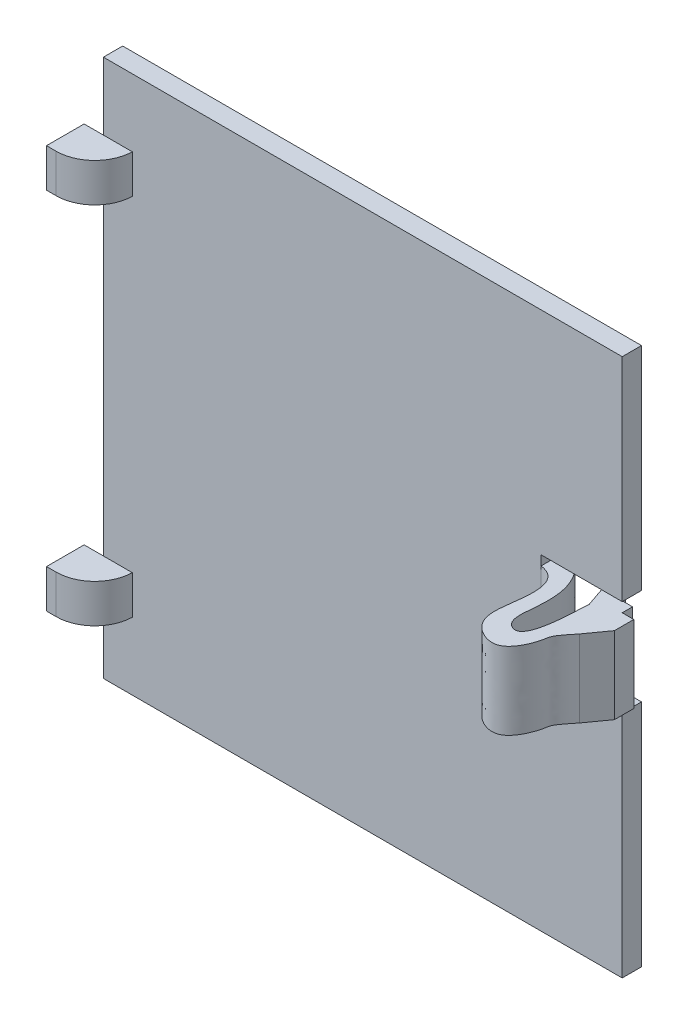
ISO-10303-21;
HEADER;
FILE_DESCRIPTION(('STEP AP214'),'2;1');
FILE_NAME('part.step','',(''),(''),'','','');
FILE_SCHEMA(('AUTOMOTIVE_DESIGN { 1 0 10303 214 1 1 1 1 }'));
ENDSEC;
DATA;
#1=APPLICATION_CONTEXT('core data for automotive mechanical design processes');
#2=APPLICATION_PROTOCOL_DEFINITION('international standard','automotive_design',2000,#1);
#3=PRODUCT_CONTEXT('',#1,'mechanical');
#4=PRODUCT('Part','Part','',(#3));
#5=PRODUCT_RELATED_PRODUCT_CATEGORY('part','',(#4));
#6=PRODUCT_DEFINITION_FORMATION('','',#4);
#7=PRODUCT_DEFINITION_CONTEXT('part definition',#1,'design');
#8=PRODUCT_DEFINITION('design','',#6,#7);
#9=PRODUCT_DEFINITION_SHAPE('','',#8);
#10=(LENGTH_UNIT() NAMED_UNIT(*) SI_UNIT(.MILLI.,.METRE.));
#11=(NAMED_UNIT(*) PLANE_ANGLE_UNIT() SI_UNIT($,.RADIAN.));
#12=(NAMED_UNIT(*) SI_UNIT($,.STERADIAN.) SOLID_ANGLE_UNIT());
#13=UNCERTAINTY_MEASURE_WITH_UNIT(LENGTH_MEASURE(1.E-05),#10,'distance_accuracy_value','');
#14=(GEOMETRIC_REPRESENTATION_CONTEXT(3) GLOBAL_UNCERTAINTY_ASSIGNED_CONTEXT((#13)) GLOBAL_UNIT_ASSIGNED_CONTEXT((#10,
#11,#12)) REPRESENTATION_CONTEXT('',''));
#15=CARTESIAN_POINT('',(0.,0.,0.));
#16=DIRECTION('',(0.,0.,1.));
#17=DIRECTION('',(1.,0.,0.));
#18=AXIS2_PLACEMENT_3D('',#15,#16,#17);
#19=CARTESIAN_POINT('',(45.3873995472666,33.8,-5.8));
#20=DIRECTION('',(-1.,0.,0.));
#21=DIRECTION('',(0.,0.,1.));
#22=AXIS2_PLACEMENT_3D('',#19,#20,#21);
#23=PLANE('',#22);
#24=DIRECTION('',(0.,0.,-1.));
#25=VECTOR('',#24,1.);
#26=CARTESIAN_POINT('',(45.3873995472666,32.8,2.));
#27=LINE('',#26,#25);
#28=CARTESIAN_POINT('',(45.3873995472666,32.8,2.));
#29=VERTEX_POINT('',#28);
#30=CARTESIAN_POINT('',(45.3873995472666,32.8,0.));
#31=VERTEX_POINT('',#30);
#32=EDGE_CURVE('E56',#29,#31,#27,.T.);
#33=ORIENTED_EDGE('',*,*,#32,.T.);
#34=DIRECTION('',(0.,1.,0.));
#35=VECTOR('',#34,1.);
#36=CARTESIAN_POINT('',(45.3873995472666,0.,0.));
#37=LINE('',#36,#35);
#38=CARTESIAN_POINT('',(45.3873995472666,33.8,0.));
#39=VERTEX_POINT('',#38);
#40=EDGE_CURVE('E456',#31,#39,#37,.T.);
#41=ORIENTED_EDGE('',*,*,#40,.T.);
#42=DIRECTION('',(0.,0.,1.));
#43=VECTOR('',#42,1.);
#44=CARTESIAN_POINT('',(45.3873995472666,33.8,-5.8));
#45=LINE('',#44,#43);
#46=CARTESIAN_POINT('',(45.3873995472666,33.8,2.));
#47=VERTEX_POINT('',#46);
#48=EDGE_CURVE('E460',#39,#47,#45,.T.);
#49=ORIENTED_EDGE('',*,*,#48,.T.);
#50=DIRECTION('',(0.,-1.,0.));
#51=VECTOR('',#50,1.);
#52=CARTESIAN_POINT('',(45.3873995472666,33.8,2.));
#53=LINE('',#52,#51);
#54=EDGE_CURVE('E506',#47,#29,#53,.T.);
#55=ORIENTED_EDGE('',*,*,#54,.T.);
#56=EDGE_LOOP('',(#33,#41,#49,#55));
#57=FACE_BOUND('',#56,.T.);
#58=ADVANCED_FACE('F33',(#57),#23,.F.);
#59=CARTESIAN_POINT('',(53.8,0.,2.));
#60=DIRECTION('',(-1.,0.,0.));
#61=DIRECTION('',(0.,0.,1.));
#62=AXIS2_PLACEMENT_3D('',#59,#60,#61);
#63=PLANE('',#62);
#64=DIRECTION('',(0.,1.,0.));
#65=VECTOR('',#64,1.);
#66=CARTESIAN_POINT('',(53.8,0.,0.));
#67=LINE('',#66,#65);
#68=CARTESIAN_POINT('',(53.8,0.,0.));
#69=VERTEX_POINT('',#68);
#70=CARTESIAN_POINT('',(53.8,23.8,0.));
#71=VERTEX_POINT('',#70);
#72=EDGE_CURVE('E413',#69,#71,#67,.T.);
#73=ORIENTED_EDGE('',*,*,#72,.T.);
#74=DIRECTION('',(0.,0.,1.));
#75=VECTOR('',#74,1.);
#76=CARTESIAN_POINT('',(53.8,23.8,-5.8));
#77=LINE('',#76,#75);
#78=CARTESIAN_POINT('',(53.8,23.8,2.));
#79=VERTEX_POINT('',#78);
#80=EDGE_CURVE('E415',#71,#79,#77,.T.);
#81=ORIENTED_EDGE('',*,*,#80,.T.);
#82=DIRECTION('',(0.,1.,0.));
#83=VECTOR('',#82,1.);
#84=CARTESIAN_POINT('',(53.8,0.,2.));
#85=LINE('',#84,#83);
#86=CARTESIAN_POINT('',(53.8,0.,2.));
#87=VERTEX_POINT('',#86);
#88=EDGE_CURVE('E479',#87,#79,#85,.T.);
#89=ORIENTED_EDGE('',*,*,#88,.F.);
#90=DIRECTION('',(0.,0.,-1.));
#91=VECTOR('',#90,1.);
#92=CARTESIAN_POINT('',(53.8,0.,2.));
#93=LINE('',#92,#91);
#94=EDGE_CURVE('E418',#87,#69,#93,.T.);
#95=ORIENTED_EDGE('',*,*,#94,.T.);
#96=EDGE_LOOP('',(#73,#81,#89,#95));
#97=FACE_BOUND('',#96,.T.);
#98=ADVANCED_FACE('F376',(#97),#63,.F.);
#99=CARTESIAN_POINT('',(0.,0.,2.));
#100=DIRECTION('',(0.,0.,-1.));
#101=DIRECTION('',(-1.,0.,0.));
#102=AXIS2_PLACEMENT_3D('',#99,#100,#101);
#103=PLANE('',#102);
#104=ORIENTED_EDGE('',*,*,#88,.T.);
#105=DIRECTION('',(1.,0.,0.));
#106=VECTOR('',#105,1.);
#107=CARTESIAN_POINT('',(53.8,23.8,2.));
#108=LINE('',#107,#106);
#109=CARTESIAN_POINT('',(45.3873995472666,23.8,2.));
#110=VERTEX_POINT('',#109);
#111=EDGE_CURVE('E512',#110,#79,#108,.T.);
#112=ORIENTED_EDGE('',*,*,#111,.F.);
#113=CARTESIAN_POINT('',(45.3873995472666,24.8,2.));
#114=VERTEX_POINT('',#113);
#115=EDGE_CURVE('E507',#114,#110,#53,.T.);
#116=ORIENTED_EDGE('',*,*,#115,.F.);
#117=DIRECTION('',(0.,1.,0.));
#118=VECTOR('',#117,1.);
#119=CARTESIAN_POINT('',(45.3873995472666,24.8,2.));
#120=LINE('',#119,#118);
#121=EDGE_CURVE('E274',#114,#29,#120,.T.);
#122=ORIENTED_EDGE('',*,*,#121,.T.);
#123=ORIENTED_EDGE('',*,*,#54,.F.);
#124=DIRECTION('',(-1.,0.,0.));
#125=VECTOR('',#124,1.);
#126=CARTESIAN_POINT('',(53.8,33.8,2.));
#127=LINE('',#126,#125);
#128=CARTESIAN_POINT('',(53.8,33.8,2.));
#129=VERTEX_POINT('',#128);
#130=EDGE_CURVE('E465',#129,#47,#127,.T.);
#131=ORIENTED_EDGE('',*,*,#130,.F.);
#132=CARTESIAN_POINT('',(53.8,55.8,2.));
#133=VERTEX_POINT('',#132);
#134=EDGE_CURVE('E481',#129,#133,#85,.T.);
#135=ORIENTED_EDGE('',*,*,#134,.T.);
#136=DIRECTION('',(-1.,0.,0.));
#137=VECTOR('',#136,1.);
#138=CARTESIAN_POINT('',(0.,55.8,2.));
#139=LINE('',#138,#137);
#140=CARTESIAN_POINT('',(0.,55.8,2.));
#141=VERTEX_POINT('',#140);
#142=EDGE_CURVE('E433',#133,#141,#139,.T.);
#143=ORIENTED_EDGE('',*,*,#142,.T.);
#144=DIRECTION('',(0.,-1.,0.));
#145=VECTOR('',#144,1.);
#146=CARTESIAN_POINT('',(0.,0.,2.));
#147=LINE('',#146,#145);
#148=CARTESIAN_POINT('',(0.,48.8,2.));
#149=VERTEX_POINT('',#148);
#150=EDGE_CURVE('E499',#141,#149,#147,.T.);
#151=ORIENTED_EDGE('',*,*,#150,.T.);
#152=DIRECTION('',(-1.,0.,0.));
#153=VECTOR('',#152,1.);
#154=CARTESIAN_POINT('',(3.,48.8,2.));
#155=LINE('',#154,#153);
#156=CARTESIAN_POINT('',(3.,48.8,2.));
#157=VERTEX_POINT('',#156);
#158=EDGE_CURVE('E531',#157,#149,#155,.T.);
#159=ORIENTED_EDGE('',*,*,#158,.F.);
#160=DIRECTION('',(0.,1.,0.));
#161=VECTOR('',#160,1.);
#162=CARTESIAN_POINT('',(3.,44.8,2.));
#163=LINE('',#162,#161);
#164=CARTESIAN_POINT('',(3.,44.8,2.));
#165=VERTEX_POINT('',#164);
#166=EDGE_CURVE('E515',#165,#157,#163,.T.);
#167=ORIENTED_EDGE('',*,*,#166,.F.);
#168=DIRECTION('',(1.,0.,0.));
#169=VECTOR('',#168,1.);
#170=CARTESIAN_POINT('',(3.,44.8,2.));
#171=LINE('',#170,#169);
#172=CARTESIAN_POINT('',(0.,44.8,2.));
#173=VERTEX_POINT('',#172);
#174=EDGE_CURVE('E536',#173,#165,#171,.T.);
#175=ORIENTED_EDGE('',*,*,#174,.F.);
#176=CARTESIAN_POINT('',(0.,11.,2.));
#177=VERTEX_POINT('',#176);
#178=EDGE_CURVE('E502',#173,#177,#147,.T.);
#179=ORIENTED_EDGE('',*,*,#178,.T.);
#180=DIRECTION('',(-1.,0.,0.));
#181=VECTOR('',#180,1.);
#182=CARTESIAN_POINT('',(3.,11.,2.));
#183=LINE('',#182,#181);
#184=CARTESIAN_POINT('',(3.,11.,2.));
#185=VERTEX_POINT('',#184);
#186=EDGE_CURVE('E555',#185,#177,#183,.T.);
#187=ORIENTED_EDGE('',*,*,#186,.F.);
#188=DIRECTION('',(0.,1.,0.));
#189=VECTOR('',#188,1.);
#190=CARTESIAN_POINT('',(3.,7.,2.));
#191=LINE('',#190,#189);
#192=CARTESIAN_POINT('',(3.,7.,2.));
#193=VERTEX_POINT('',#192);
#194=EDGE_CURVE('E544',#193,#185,#191,.T.);
#195=ORIENTED_EDGE('',*,*,#194,.F.);
#196=DIRECTION('',(1.,0.,0.));
#197=VECTOR('',#196,1.);
#198=CARTESIAN_POINT('',(3.,7.,2.));
#199=LINE('',#198,#197);
#200=CARTESIAN_POINT('',(0.,7.,2.));
#201=VERTEX_POINT('',#200);
#202=EDGE_CURVE('E440',#201,#193,#199,.T.);
#203=ORIENTED_EDGE('',*,*,#202,.F.);
#204=CARTESIAN_POINT('',(0.,0.,2.));
#205=VERTEX_POINT('',#204);
#206=EDGE_CURVE('E423',#201,#205,#147,.T.);
#207=ORIENTED_EDGE('',*,*,#206,.T.);
#208=DIRECTION('',(1.,0.,0.));
#209=VECTOR('',#208,1.);
#210=CARTESIAN_POINT('',(0.,0.,2.));
#211=LINE('',#210,#209);
#212=EDGE_CURVE('E500',#205,#87,#211,.T.);
#213=ORIENTED_EDGE('',*,*,#212,.T.);
#214=EDGE_LOOP('',(#104,#112,#116,#122,#123,#131,#135,#143,#151,#159,#167,#175,#179,#187,#195,
#203,#207,#213));
#215=FACE_BOUND('',#214,.T.);
#216=ADVANCED_FACE('F372',(#215),#103,.F.);
#217=CARTESIAN_POINT('',(0.,0.,2.));
#218=DIRECTION('',(1.,0.,0.));
#219=DIRECTION('',(0.,0.,-1.));
#220=AXIS2_PLACEMENT_3D('',#217,#218,#219);
#221=PLANE('',#220);
#222=DIRECTION('',(0.,-1.,0.));
#223=VECTOR('',#222,1.);
#224=CARTESIAN_POINT('',(0.,0.,0.));
#225=LINE('',#224,#223);
#226=CARTESIAN_POINT('',(0.,55.8,0.));
#227=VERTEX_POINT('',#226);
#228=CARTESIAN_POINT('',(0.,0.,0.));
#229=VERTEX_POINT('',#228);
#230=EDGE_CURVE('E484',#227,#229,#225,.T.);
#231=ORIENTED_EDGE('',*,*,#230,.T.);
#232=DIRECTION('',(0.,0.,-1.));
#233=VECTOR('',#232,1.);
#234=CARTESIAN_POINT('',(0.,0.,2.));
#235=LINE('',#234,#233);
#236=EDGE_CURVE('E437',#205,#229,#235,.T.);
#237=ORIENTED_EDGE('',*,*,#236,.F.);
#238=ORIENTED_EDGE('',*,*,#206,.F.);
#239=EDGE_CURVE('E503',#177,#201,#147,.T.);
#240=ORIENTED_EDGE('',*,*,#239,.F.);
#241=ORIENTED_EDGE('',*,*,#178,.F.);
#242=EDGE_CURVE('E501',#149,#173,#147,.T.);
#243=ORIENTED_EDGE('',*,*,#242,.F.);
#244=ORIENTED_EDGE('',*,*,#150,.F.);
#245=DIRECTION('',(0.,0.,-1.));
#246=VECTOR('',#245,1.);
#247=CARTESIAN_POINT('',(0.,55.8,2.));
#248=LINE('',#247,#246);
#249=EDGE_CURVE('E429',#141,#227,#248,.T.);
#250=ORIENTED_EDGE('',*,*,#249,.T.);
#251=EDGE_LOOP('',(#231,#237,#238,#240,#241,#243,#244,#250));
#252=FACE_BOUND('',#251,.T.);
#253=ADVANCED_FACE('F375',(#252),#221,.F.);
#254=CARTESIAN_POINT('',(0.,0.,2.));
#255=DIRECTION('',(0.,1.,0.));
#256=DIRECTION('',(0.,0.,1.));
#257=AXIS2_PLACEMENT_3D('',#254,#255,#256);
#258=PLANE('',#257);
#259=DIRECTION('',(1.,0.,0.));
#260=VECTOR('',#259,1.);
#261=CARTESIAN_POINT('',(0.,0.,0.));
#262=LINE('',#261,#260);
#263=EDGE_CURVE('E425',#229,#69,#262,.T.);
#264=ORIENTED_EDGE('',*,*,#263,.T.);
#265=ORIENTED_EDGE('',*,*,#94,.F.);
#266=ORIENTED_EDGE('',*,*,#212,.F.);
#267=ORIENTED_EDGE('',*,*,#236,.T.);
#268=EDGE_LOOP('',(#264,#265,#266,#267));
#269=FACE_BOUND('',#268,.T.);
#270=ADVANCED_FACE('F388',(#269),#258,.F.);
#271=ORIENTED_EDGE('',*,*,#134,.F.);
#272=DIRECTION('',(0.,0.,1.));
#273=VECTOR('',#272,1.);
#274=CARTESIAN_POINT('',(53.8,33.8,-5.8));
#275=LINE('',#274,#273);
#276=CARTESIAN_POINT('',(53.8,33.8,0.));
#277=VERTEX_POINT('',#276);
#278=EDGE_CURVE('E468',#277,#129,#275,.T.);
#279=ORIENTED_EDGE('',*,*,#278,.F.);
#280=CARTESIAN_POINT('',(53.8,55.8,0.));
#281=VERTEX_POINT('',#280);
#282=EDGE_CURVE('E421',#277,#281,#67,.T.);
#283=ORIENTED_EDGE('',*,*,#282,.T.);
#284=DIRECTION('',(0.,0.,-1.));
#285=VECTOR('',#284,1.);
#286=CARTESIAN_POINT('',(53.8,55.8,2.));
#287=LINE('',#286,#285);
#288=EDGE_CURVE('E432',#133,#281,#287,.T.);
#289=ORIENTED_EDGE('',*,*,#288,.F.);
#290=EDGE_LOOP('',(#271,#279,#283,#289));
#291=FACE_BOUND('',#290,.T.);
#292=ADVANCED_FACE('F384',(#291),#63,.F.);
#293=CARTESIAN_POINT('',(0.,55.8,2.));
#294=DIRECTION('',(0.,-1.,0.));
#295=DIRECTION('',(0.,0.,-1.));
#296=AXIS2_PLACEMENT_3D('',#293,#294,#295);
#297=PLANE('',#296);
#298=DIRECTION('',(-1.,0.,0.));
#299=VECTOR('',#298,1.);
#300=CARTESIAN_POINT('',(0.,55.8,0.));
#301=LINE('',#300,#299);
#302=EDGE_CURVE('E420',#281,#227,#301,.T.);
#303=ORIENTED_EDGE('',*,*,#302,.T.);
#304=ORIENTED_EDGE('',*,*,#249,.F.);
#305=ORIENTED_EDGE('',*,*,#142,.F.);
#306=ORIENTED_EDGE('',*,*,#288,.T.);
#307=EDGE_LOOP('',(#303,#304,#305,#306));
#308=FACE_BOUND('',#307,.T.);
#309=ADVANCED_FACE('F380',(#308),#297,.F.);
#310=CARTESIAN_POINT('',(0.,0.,0.));
#311=DIRECTION('',(0.,0.,-1.));
#312=DIRECTION('',(-1.,0.,0.));
#313=AXIS2_PLACEMENT_3D('',#310,#311,#312);
#314=PLANE('',#313);
#315=DIRECTION('',(-1.,0.,0.));
#316=VECTOR('',#315,1.);
#317=CARTESIAN_POINT('',(0.,23.8,0.));
#318=LINE('',#317,#316);
#319=CARTESIAN_POINT('',(45.3873995472666,23.8,0.));
#320=VERTEX_POINT('',#319);
#321=EDGE_CURVE('E11',#71,#320,#318,.T.);
#322=ORIENTED_EDGE('',*,*,#321,.F.);
#323=ORIENTED_EDGE('',*,*,#72,.F.);
#324=ORIENTED_EDGE('',*,*,#263,.F.);
#325=ORIENTED_EDGE('',*,*,#230,.F.);
#326=ORIENTED_EDGE('',*,*,#302,.F.);
#327=ORIENTED_EDGE('',*,*,#282,.F.);
#328=DIRECTION('',(1.,0.,0.));
#329=VECTOR('',#328,1.);
#330=CARTESIAN_POINT('',(0.,33.8,0.));
#331=LINE('',#330,#329);
#332=EDGE_CURVE('E455',#39,#277,#331,.T.);
#333=ORIENTED_EDGE('',*,*,#332,.F.);
#334=ORIENTED_EDGE('',*,*,#40,.F.);
#335=DIRECTION('',(0.,1.,0.));
#336=VECTOR('',#335,1.);
#337=CARTESIAN_POINT('',(45.3873995472666,24.8,0.));
#338=LINE('',#337,#336);
#339=CARTESIAN_POINT('',(45.3873995472666,24.8,0.));
#340=VERTEX_POINT('',#339);
#341=EDGE_CURVE('E243',#340,#31,#338,.T.);
#342=ORIENTED_EDGE('',*,*,#341,.F.);
#343=EDGE_CURVE('E41',#320,#340,#37,.T.);
#344=ORIENTED_EDGE('',*,*,#343,.F.);
#345=EDGE_LOOP('',(#322,#323,#324,#325,#326,#327,#333,#334,#342,#344));
#346=FACE_BOUND('',#345,.T.);
#347=ADVANCED_FACE('F360',(#346),#314,.T.);
#348=CARTESIAN_POINT('',(0.,0.,2.));
#349=DIRECTION('',(0.,0.,1.));
#350=DIRECTION('',(1.,0.,0.));
#351=AXIS2_PLACEMENT_3D('',#348,#349,#350);
#352=PLANE('',#351);
#353=CARTESIAN_POINT('',(-2.,11.,2.));
#354=VERTEX_POINT('',#353);
#355=EDGE_CURVE('E554',#177,#354,#183,.T.);
#356=ORIENTED_EDGE('',*,*,#355,.F.);
#357=ORIENTED_EDGE('',*,*,#239,.T.);
#358=CARTESIAN_POINT('',(-2.,7.,2.));
#359=VERTEX_POINT('',#358);
#360=EDGE_CURVE('E548',#359,#201,#199,.T.);
#361=ORIENTED_EDGE('',*,*,#360,.F.);
#362=DIRECTION('',(0.,-1.,0.));
#363=VECTOR('',#362,1.);
#364=CARTESIAN_POINT('',(-2.,7.,2.));
#365=LINE('',#364,#363);
#366=EDGE_CURVE('E558',#354,#359,#365,.T.);
#367=ORIENTED_EDGE('',*,*,#366,.F.);
#368=EDGE_LOOP('',(#356,#357,#361,#367));
#369=FACE_BOUND('',#368,.T.);
#370=ADVANCED_FACE('F356',(#369),#352,.F.);
#371=CARTESIAN_POINT('',(3.,11.,5.9));
#372=DIRECTION('',(0.,-1.,0.));
#373=DIRECTION('',(0.,0.,-1.));
#374=AXIS2_PLACEMENT_3D('',#371,#372,#373);
#375=PLANE('',#374);
#376=DIRECTION('',(-1.,0.,0.));
#377=VECTOR('',#376,1.);
#378=CARTESIAN_POINT('',(3.,11.,5.9));
#379=LINE('',#378,#377);
#380=CARTESIAN_POINT('',(-0.998749804626441,11.,5.9));
#381=VERTEX_POINT('',#380);
#382=CARTESIAN_POINT('',(-2.,11.,5.9));
#383=VERTEX_POINT('',#382);
#384=EDGE_CURVE('E545',#381,#383,#379,.T.);
#385=ORIENTED_EDGE('',*,*,#384,.F.);
#386=CARTESIAN_POINT('',(-0.998749804626441,11.,1.9));
#387=DIRECTION('',(0.,-1.,0.));
#388=DIRECTION('',(0.,0.,-1.));
#389=AXIS2_PLACEMENT_3D('',#386,#387,#388);
#390=CIRCLE('',#389,4.);
#391=EDGE_CURVE('E451',#381,#185,#390,.F.);
#392=ORIENTED_EDGE('',*,*,#391,.T.);
#393=ORIENTED_EDGE('',*,*,#186,.T.);
#394=ORIENTED_EDGE('',*,*,#355,.T.);
#395=DIRECTION('',(0.,0.,-1.));
#396=VECTOR('',#395,1.);
#397=CARTESIAN_POINT('',(-2.,11.,5.9));
#398=LINE('',#397,#396);
#399=EDGE_CURVE('E486',#383,#354,#398,.T.);
#400=ORIENTED_EDGE('',*,*,#399,.F.);
#401=EDGE_LOOP('',(#385,#392,#393,#394,#400));
#402=FACE_BOUND('',#401,.T.);
#403=ADVANCED_FACE('F359',(#402),#375,.F.);
#404=CARTESIAN_POINT('',(-2.,7.,5.9));
#405=DIRECTION('',(1.,0.,0.));
#406=DIRECTION('',(0.,0.,-1.));
#407=AXIS2_PLACEMENT_3D('',#404,#405,#406);
#408=PLANE('',#407);
#409=ORIENTED_EDGE('',*,*,#366,.T.);
#410=DIRECTION('',(0.,0.,-1.));
#411=VECTOR('',#410,1.);
#412=CARTESIAN_POINT('',(-2.,7.,5.9));
#413=LINE('',#412,#411);
#414=CARTESIAN_POINT('',(-2.,7.,5.9));
#415=VERTEX_POINT('',#414);
#416=EDGE_CURVE('E489',#415,#359,#413,.T.);
#417=ORIENTED_EDGE('',*,*,#416,.F.);
#418=DIRECTION('',(0.,-1.,0.));
#419=VECTOR('',#418,1.);
#420=CARTESIAN_POINT('',(-2.,7.,5.9));
#421=LINE('',#420,#419);
#422=EDGE_CURVE('E547',#383,#415,#421,.T.);
#423=ORIENTED_EDGE('',*,*,#422,.F.);
#424=ORIENTED_EDGE('',*,*,#399,.T.);
#425=EDGE_LOOP('',(#409,#417,#423,#424));
#426=FACE_BOUND('',#425,.T.);
#427=ADVANCED_FACE('F364',(#426),#408,.F.);
#428=CARTESIAN_POINT('',(3.,7.,5.9));
#429=DIRECTION('',(0.,1.,0.));
#430=DIRECTION('',(0.,0.,1.));
#431=AXIS2_PLACEMENT_3D('',#428,#429,#430);
#432=PLANE('',#431);
#433=ORIENTED_EDGE('',*,*,#202,.T.);
#434=CARTESIAN_POINT('',(-0.99874980462644,7.,1.9));
#435=DIRECTION('',(0.,1.,0.));
#436=DIRECTION('',(0.,0.,1.));
#437=AXIS2_PLACEMENT_3D('',#434,#435,#436);
#438=CIRCLE('',#437,4.);
#439=CARTESIAN_POINT('',(-0.99874980462644,7.,5.9));
#440=VERTEX_POINT('',#439);
#441=EDGE_CURVE('E453',#193,#440,#438,.F.);
#442=ORIENTED_EDGE('',*,*,#441,.T.);
#443=DIRECTION('',(1.,0.,0.));
#444=VECTOR('',#443,1.);
#445=CARTESIAN_POINT('',(3.,7.,5.9));
#446=LINE('',#445,#444);
#447=EDGE_CURVE('E495',#415,#440,#446,.T.);
#448=ORIENTED_EDGE('',*,*,#447,.F.);
#449=ORIENTED_EDGE('',*,*,#416,.T.);
#450=ORIENTED_EDGE('',*,*,#360,.T.);
#451=EDGE_LOOP('',(#433,#442,#448,#449,#450));
#452=FACE_BOUND('',#451,.T.);
#453=ADVANCED_FACE('F354',(#452),#432,.F.);
#454=CARTESIAN_POINT('',(0.,0.,5.9));
#455=DIRECTION('',(0.,0.,1.));
#456=DIRECTION('',(1.,0.,0.));
#457=AXIS2_PLACEMENT_3D('',#454,#455,#456);
#458=PLANE('',#457);
#459=ORIENTED_EDGE('',*,*,#447,.T.);
#460=DIRECTION('',(0.,1.,0.));
#461=VECTOR('',#460,1.);
#462=CARTESIAN_POINT('',(-0.998749804626441,11.,5.9));
#463=LINE('',#462,#461);
#464=EDGE_CURVE('E448',#440,#381,#463,.T.);
#465=ORIENTED_EDGE('',*,*,#464,.T.);
#466=ORIENTED_EDGE('',*,*,#384,.T.);
#467=ORIENTED_EDGE('',*,*,#422,.T.);
#468=EDGE_LOOP('',(#459,#465,#466,#467));
#469=FACE_BOUND('',#468,.T.);
#470=ADVANCED_FACE('F340',(#469),#458,.T.);
#471=CARTESIAN_POINT('',(0.,0.,2.));
#472=DIRECTION('',(0.,0.,1.));
#473=DIRECTION('',(1.,0.,0.));
#474=AXIS2_PLACEMENT_3D('',#471,#472,#473);
#475=PLANE('',#474);
#476=CARTESIAN_POINT('',(-2.,48.8,2.));
#477=VERTEX_POINT('',#476);
#478=EDGE_CURVE('E530',#149,#477,#155,.T.);
#479=ORIENTED_EDGE('',*,*,#478,.F.);
#480=ORIENTED_EDGE('',*,*,#242,.T.);
#481=CARTESIAN_POINT('',(-2.,44.8,2.));
#482=VERTEX_POINT('',#481);
#483=EDGE_CURVE('E522',#482,#173,#171,.T.);
#484=ORIENTED_EDGE('',*,*,#483,.F.);
#485=DIRECTION('',(0.,-1.,0.));
#486=VECTOR('',#485,1.);
#487=CARTESIAN_POINT('',(-2.,44.8,2.));
#488=LINE('',#487,#486);
#489=EDGE_CURVE('E534',#477,#482,#488,.T.);
#490=ORIENTED_EDGE('',*,*,#489,.F.);
#491=EDGE_LOOP('',(#479,#480,#484,#490));
#492=FACE_BOUND('',#491,.T.);
#493=ADVANCED_FACE('F336',(#492),#475,.F.);
#494=CARTESIAN_POINT('',(3.,48.8,5.9));
#495=DIRECTION('',(0.,-1.,0.));
#496=DIRECTION('',(0.,0.,-1.));
#497=AXIS2_PLACEMENT_3D('',#494,#495,#496);
#498=PLANE('',#497);
#499=DIRECTION('',(-1.,0.,0.));
#500=VECTOR('',#499,1.);
#501=CARTESIAN_POINT('',(3.,48.8,5.9));
#502=LINE('',#501,#500);
#503=CARTESIAN_POINT('',(-0.99874980462644,48.8,5.9));
#504=VERTEX_POINT('',#503);
#505=CARTESIAN_POINT('',(-2.,48.8,5.9));
#506=VERTEX_POINT('',#505);
#507=EDGE_CURVE('E519',#504,#506,#502,.T.);
#508=ORIENTED_EDGE('',*,*,#507,.F.);
#509=CARTESIAN_POINT('',(-0.99874980462644,48.8,1.9));
#510=DIRECTION('',(0.,-1.,0.));
#511=DIRECTION('',(0.,0.,-1.));
#512=AXIS2_PLACEMENT_3D('',#509,#510,#511);
#513=CIRCLE('',#512,4.);
#514=EDGE_CURVE('E444',#504,#157,#513,.F.);
#515=ORIENTED_EDGE('',*,*,#514,.T.);
#516=ORIENTED_EDGE('',*,*,#158,.T.);
#517=ORIENTED_EDGE('',*,*,#478,.T.);
#518=DIRECTION('',(0.,0.,-1.));
#519=VECTOR('',#518,1.);
#520=CARTESIAN_POINT('',(-2.,48.8,5.9));
#521=LINE('',#520,#519);
#522=EDGE_CURVE('E541',#506,#477,#521,.T.);
#523=ORIENTED_EDGE('',*,*,#522,.F.);
#524=EDGE_LOOP('',(#508,#515,#516,#517,#523));
#525=FACE_BOUND('',#524,.T.);
#526=ADVANCED_FACE('F339',(#525),#498,.F.);
#527=CARTESIAN_POINT('',(-2.,44.8,5.9));
#528=DIRECTION('',(1.,0.,0.));
#529=DIRECTION('',(0.,1.,0.));
#530=AXIS2_PLACEMENT_3D('',#527,#528,#529);
#531=PLANE('',#530);
#532=ORIENTED_EDGE('',*,*,#489,.T.);
#533=DIRECTION('',(0.,0.,-1.));
#534=VECTOR('',#533,1.);
#535=CARTESIAN_POINT('',(-2.,44.8,5.9));
#536=LINE('',#535,#534);
#537=CARTESIAN_POINT('',(-2.,44.8,5.9));
#538=VERTEX_POINT('',#537);
#539=EDGE_CURVE('E527',#538,#482,#536,.T.);
#540=ORIENTED_EDGE('',*,*,#539,.F.);
#541=DIRECTION('',(0.,-1.,0.));
#542=VECTOR('',#541,1.);
#543=CARTESIAN_POINT('',(-2.,44.8,5.9));
#544=LINE('',#543,#542);
#545=EDGE_CURVE('E521',#506,#538,#544,.T.);
#546=ORIENTED_EDGE('',*,*,#545,.F.);
#547=ORIENTED_EDGE('',*,*,#522,.T.);
#548=EDGE_LOOP('',(#532,#540,#546,#547));
#549=FACE_BOUND('',#548,.T.);
#550=ADVANCED_FACE('F344',(#549),#531,.F.);
#551=CARTESIAN_POINT('',(3.,44.8,5.9));
#552=DIRECTION('',(0.,1.,0.));
#553=DIRECTION('',(0.,0.,1.));
#554=AXIS2_PLACEMENT_3D('',#551,#552,#553);
#555=PLANE('',#554);
#556=ORIENTED_EDGE('',*,*,#174,.T.);
#557=CARTESIAN_POINT('',(-0.99874980462644,44.8,1.9));
#558=DIRECTION('',(0.,1.,0.));
#559=DIRECTION('',(0.,0.,1.));
#560=AXIS2_PLACEMENT_3D('',#557,#558,#559);
#561=CIRCLE('',#560,4.);
#562=CARTESIAN_POINT('',(-0.99874980462644,44.8,5.9));
#563=VERTEX_POINT('',#562);
#564=EDGE_CURVE('E446',#165,#563,#561,.F.);
#565=ORIENTED_EDGE('',*,*,#564,.T.);
#566=DIRECTION('',(1.,0.,0.));
#567=VECTOR('',#566,1.);
#568=CARTESIAN_POINT('',(3.,44.8,5.9));
#569=LINE('',#568,#567);
#570=EDGE_CURVE('E524',#538,#563,#569,.T.);
#571=ORIENTED_EDGE('',*,*,#570,.F.);
#572=ORIENTED_EDGE('',*,*,#539,.T.);
#573=ORIENTED_EDGE('',*,*,#483,.T.);
#574=EDGE_LOOP('',(#556,#565,#571,#572,#573));
#575=FACE_BOUND('',#574,.T.);
#576=ADVANCED_FACE('F334',(#575),#555,.F.);
#577=CARTESIAN_POINT('',(0.,0.,5.9));
#578=DIRECTION('',(0.,0.,1.));
#579=DIRECTION('',(1.,0.,0.));
#580=AXIS2_PLACEMENT_3D('',#577,#578,#579);
#581=PLANE('',#580);
#582=ORIENTED_EDGE('',*,*,#570,.T.);
#583=DIRECTION('',(0.,1.,0.));
#584=VECTOR('',#583,1.);
#585=CARTESIAN_POINT('',(-0.99874980462644,48.8,5.9));
#586=LINE('',#585,#584);
#587=EDGE_CURVE('E441',#563,#504,#586,.T.);
#588=ORIENTED_EDGE('',*,*,#587,.T.);
#589=ORIENTED_EDGE('',*,*,#507,.T.);
#590=ORIENTED_EDGE('',*,*,#545,.T.);
#591=EDGE_LOOP('',(#582,#588,#589,#590));
#592=FACE_BOUND('',#591,.T.);
#593=ADVANCED_FACE('F330',(#592),#581,.T.);
#594=CARTESIAN_POINT('',(-0.99874980462644,44.8,1.9));
#595=DIRECTION('',(0.,-1.,0.));
#596=DIRECTION('',(0.,0.,-1.));
#597=AXIS2_PLACEMENT_3D('',#594,#595,#596);
#598=CYLINDRICAL_SURFACE('',#597,4.);
#599=ORIENTED_EDGE('',*,*,#564,.F.);
#600=ORIENTED_EDGE('',*,*,#166,.T.);
#601=ORIENTED_EDGE('',*,*,#514,.F.);
#602=ORIENTED_EDGE('',*,*,#587,.F.);
#603=EDGE_LOOP('',(#599,#600,#601,#602));
#604=FACE_BOUND('',#603,.T.);
#605=ADVANCED_FACE('F333',(#604),#598,.T.);
#606=CARTESIAN_POINT('',(-0.99874980462644,7.,1.9));
#607=DIRECTION('',(0.,-1.,0.));
#608=DIRECTION('',(1.,0.,0.));
#609=AXIS2_PLACEMENT_3D('',#606,#607,#608);
#610=CYLINDRICAL_SURFACE('',#609,4.);
#611=ORIENTED_EDGE('',*,*,#441,.F.);
#612=ORIENTED_EDGE('',*,*,#194,.T.);
#613=ORIENTED_EDGE('',*,*,#391,.F.);
#614=ORIENTED_EDGE('',*,*,#464,.F.);
#615=EDGE_LOOP('',(#611,#612,#613,#614));
#616=FACE_BOUND('',#615,.T.);
#617=ADVANCED_FACE('F35',(#616),#610,.T.);
#618=CARTESIAN_POINT('',(53.8,23.8,-5.8));
#619=DIRECTION('',(0.,-1.,0.));
#620=DIRECTION('',(1.,0.,0.));
#621=AXIS2_PLACEMENT_3D('',#618,#619,#620);
#622=PLANE('',#621);
#623=ORIENTED_EDGE('',*,*,#321,.T.);
#624=DIRECTION('',(0.,0.,1.));
#625=VECTOR('',#624,1.);
#626=CARTESIAN_POINT('',(45.3873995472666,23.8,-5.8));
#627=LINE('',#626,#625);
#628=EDGE_CURVE('E467',#320,#110,#627,.T.);
#629=ORIENTED_EDGE('',*,*,#628,.T.);
#630=ORIENTED_EDGE('',*,*,#111,.T.);
#631=ORIENTED_EDGE('',*,*,#80,.F.);
#632=EDGE_LOOP('',(#623,#629,#630,#631));
#633=FACE_BOUND('',#632,.T.);
#634=ADVANCED_FACE('F320',(#633),#622,.F.);
#635=ORIENTED_EDGE('',*,*,#343,.T.);
#636=DIRECTION('',(0.,0.,-1.));
#637=VECTOR('',#636,1.);
#638=CARTESIAN_POINT('',(45.3873995472666,24.8,2.));
#639=LINE('',#638,#637);
#640=EDGE_CURVE('E48',#114,#340,#639,.T.);
#641=ORIENTED_EDGE('',*,*,#640,.F.);
#642=ORIENTED_EDGE('',*,*,#115,.T.);
#643=ORIENTED_EDGE('',*,*,#628,.F.);
#644=EDGE_LOOP('',(#635,#641,#642,#643));
#645=FACE_BOUND('',#644,.T.);
#646=ADVANCED_FACE('F323',(#645),#23,.F.);
#647=CARTESIAN_POINT('',(53.8,33.8,-5.8));
#648=DIRECTION('',(0.,1.,0.));
#649=DIRECTION('',(0.,0.,1.));
#650=AXIS2_PLACEMENT_3D('',#647,#648,#649);
#651=PLANE('',#650);
#652=ORIENTED_EDGE('',*,*,#332,.T.);
#653=ORIENTED_EDGE('',*,*,#278,.T.);
#654=ORIENTED_EDGE('',*,*,#130,.T.);
#655=ORIENTED_EDGE('',*,*,#48,.F.);
#656=EDGE_LOOP('',(#652,#653,#654,#655));
#657=FACE_BOUND('',#656,.T.);
#658=ADVANCED_FACE('F319',(#657),#651,.F.);
#659=CARTESIAN_POINT('',(45.3873995472666,24.8,0.));
#660=CARTESIAN_POINT('',(46.455010673029,24.8,0.0307749566576464));
#661=CARTESIAN_POINT('',(47.1255950648169,24.8,-0.0213447450936967));
#662=CARTESIAN_POINT('',(48.8996147952977,24.8,2.48053369682814));
#663=CARTESIAN_POINT('',(48.9573063873231,24.8,5.36869240860161));
#664=CARTESIAN_POINT('',(48.4913591160863,24.8,8.60270759845197));
#665=CARTESIAN_POINT('',(50.0819248538495,24.8,9.31391550005736));
#666=CARTESIAN_POINT('',(51.361168313441,24.8,7.44142706994953));
#667=CARTESIAN_POINT('',(51.2508336997575,24.8,3.22387809384247));
#668=CARTESIAN_POINT('',(51.3363569361531,24.8,2.96730838465582));
#669=B_SPLINE_CURVE_WITH_KNOTS('',3,(#659,#660,#661,#662,#663,#664,#665,#666,#667,#668),
.UNSPECIFIED.,.F.,.F.,(4,1,1,1,1,1,1,4),(0.,0.100124677415875,0.177204473920594,
0.427983886940621,0.587008200337766,0.626058963579576,0.727290755603036,1.),.UNSPECIFIED.);
#670=DIRECTION('',(0.,1.,0.));
#671=VECTOR('',#670,1.);
#672=SURFACE_OF_LINEAR_EXTRUSION('',#669,#671);
#673=CARTESIAN_POINT('',(45.3873995472666,32.8,0.));
#674=CARTESIAN_POINT('',(46.455010673029,32.8,0.0307749566576464));
#675=CARTESIAN_POINT('',(47.1255950648169,32.8,-0.0213447450936967));
#676=CARTESIAN_POINT('',(48.8996147952977,32.8,2.48053369682814));
#677=CARTESIAN_POINT('',(48.9573063873231,32.8,5.36869240860161));
#678=CARTESIAN_POINT('',(48.4913591160863,32.8,8.60270759845197));
#679=CARTESIAN_POINT('',(50.0819248538495,32.8,9.31391550005736));
#680=CARTESIAN_POINT('',(51.361168313441,32.8,7.44142706994953));
#681=CARTESIAN_POINT('',(51.2508336997575,32.8,3.22387809384247));
#682=CARTESIAN_POINT('',(51.3363569361531,32.8,2.96730838465582));
#683=B_SPLINE_CURVE_WITH_KNOTS('',3,(#673,#674,#675,#676,#677,#678,#679,#680,#681,#682),
.UNSPECIFIED.,.F.,.F.,(4,1,1,1,1,1,1,4),(0.,0.100124677415875,0.177204473920594,
0.427983886940621,0.587008200337766,0.626058963579576,0.727290755603036,1.),.UNSPECIFIED.);
#684=CARTESIAN_POINT('',(51.3363569361531,32.8,2.96730838465582));
#685=VERTEX_POINT('',#684);
#686=EDGE_CURVE('E239',#31,#685,#683,.T.);
#687=ORIENTED_EDGE('',*,*,#686,.T.);
#688=DIRECTION('',(0.,1.,0.));
#689=VECTOR('',#688,1.);
#690=CARTESIAN_POINT('',(51.3363569361531,24.8,2.96730838465582));
#691=LINE('',#690,#689);
#692=CARTESIAN_POINT('',(51.3363569361531,24.8,2.96730838465582));
#693=VERTEX_POINT('',#692);
#694=EDGE_CURVE('E236',#693,#685,#691,.T.);
#695=ORIENTED_EDGE('',*,*,#694,.F.);
#696=EDGE_CURVE('E224',#340,#693,#669,.T.);
#697=ORIENTED_EDGE('',*,*,#696,.F.);
#698=ORIENTED_EDGE('',*,*,#341,.T.);
#699=EDGE_LOOP('',(#687,#695,#697,#698));
#700=FACE_BOUND('',#699,.T.);
#701=ADVANCED_FACE('F237',(#700),#672,.F.);
#702=CARTESIAN_POINT('',(50.3139812810822,24.8,0.));
#703=DIRECTION('',(-0.945454858906093,0.,0.325753142380638));
#704=DIRECTION('',(0.325753142380638,0.,0.945454858906093));
#705=AXIS2_PLACEMENT_3D('',#702,#703,#704);
#706=PLANE('',#705);
#707=DIRECTION('',(0.325753142380638,0.,0.945454858906093));
#708=VECTOR('',#707,1.);
#709=CARTESIAN_POINT('',(50.3139812810822,32.8,0.));
#710=LINE('',#709,#708);
#711=CARTESIAN_POINT('',(50.3139812810822,32.8,0.));
#712=VERTEX_POINT('',#711);
#713=EDGE_CURVE('E622',#712,#685,#710,.T.);
#714=ORIENTED_EDGE('',*,*,#713,.F.);
#715=DIRECTION('',(0.,1.,0.));
#716=VECTOR('',#715,1.);
#717=CARTESIAN_POINT('',(50.3139812810822,24.8,0.));
#718=LINE('',#717,#716);
#719=CARTESIAN_POINT('',(50.3139812810822,24.8,0.));
#720=VERTEX_POINT('',#719);
#721=EDGE_CURVE('E244',#720,#712,#718,.T.);
#722=ORIENTED_EDGE('',*,*,#721,.F.);
#723=DIRECTION('',(0.325753142380638,0.,0.945454858906093));
#724=VECTOR('',#723,1.);
#725=CARTESIAN_POINT('',(50.3139812810822,24.8,0.));
#726=LINE('',#725,#724);
#727=EDGE_CURVE('E229',#720,#693,#726,.T.);
#728=ORIENTED_EDGE('',*,*,#727,.T.);
#729=ORIENTED_EDGE('',*,*,#694,.T.);
#730=EDGE_LOOP('',(#714,#722,#728,#729));
#731=FACE_BOUND('',#730,.T.);
#732=ADVANCED_FACE('F246',(#731),#706,.T.);
#733=CARTESIAN_POINT('',(52.1165379417575,24.8,0.));
#734=DIRECTION('',(0.,0.,-1.));
#735=DIRECTION('',(-1.,0.,0.));
#736=AXIS2_PLACEMENT_3D('',#733,#734,#735);
#737=PLANE('',#736);
#738=DIRECTION('',(-1.,0.,0.));
#739=VECTOR('',#738,1.);
#740=CARTESIAN_POINT('',(52.1165379417575,32.8,0.));
#741=LINE('',#740,#739);
#742=CARTESIAN_POINT('',(52.1165379417575,32.8,0.));
#743=VERTEX_POINT('',#742);
#744=EDGE_CURVE('E620',#743,#712,#741,.T.);
#745=ORIENTED_EDGE('',*,*,#744,.F.);
#746=DIRECTION('',(0.,1.,0.));
#747=VECTOR('',#746,1.);
#748=CARTESIAN_POINT('',(52.1165379417575,24.8,0.));
#749=LINE('',#748,#747);
#750=CARTESIAN_POINT('',(52.1165379417575,24.8,0.));
#751=VERTEX_POINT('',#750);
#752=EDGE_CURVE('E616',#751,#743,#749,.T.);
#753=ORIENTED_EDGE('',*,*,#752,.F.);
#754=DIRECTION('',(-1.,0.,0.));
#755=VECTOR('',#754,1.);
#756=CARTESIAN_POINT('',(52.1165379417575,24.8,0.));
#757=LINE('',#756,#755);
#758=EDGE_CURVE('E247',#751,#720,#757,.T.);
#759=ORIENTED_EDGE('',*,*,#758,.T.);
#760=ORIENTED_EDGE('',*,*,#721,.T.);
#761=EDGE_LOOP('',(#745,#753,#759,#760));
#762=FACE_BOUND('',#761,.T.);
#763=ADVANCED_FACE('F310',(#762),#737,.T.);
#764=CARTESIAN_POINT('',(52.1165379417575,24.8,0.927515672621293));
#765=DIRECTION('',(1.,0.,0.));
#766=DIRECTION('',(0.,0.,-1.));
#767=AXIS2_PLACEMENT_3D('',#764,#765,#766);
#768=PLANE('',#767);
#769=DIRECTION('',(0.,0.,-1.));
#770=VECTOR('',#769,1.);
#771=CARTESIAN_POINT('',(52.1165379417575,32.8,0.927515672621293));
#772=LINE('',#771,#770);
#773=CARTESIAN_POINT('',(52.1165379417575,32.8,0.927515672621293));
#774=VERTEX_POINT('',#773);
#775=EDGE_CURVE('E627',#774,#743,#772,.T.);
#776=ORIENTED_EDGE('',*,*,#775,.F.);
#777=DIRECTION('',(0.,1.,0.));
#778=VECTOR('',#777,1.);
#779=CARTESIAN_POINT('',(52.1165379417575,24.8,0.927515672621293));
#780=LINE('',#779,#778);
#781=CARTESIAN_POINT('',(52.1165379417575,24.8,0.927515672621293));
#782=VERTEX_POINT('',#781);
#783=EDGE_CURVE('E614',#782,#774,#780,.T.);
#784=ORIENTED_EDGE('',*,*,#783,.F.);
#785=DIRECTION('',(0.,0.,-1.));
#786=VECTOR('',#785,1.);
#787=CARTESIAN_POINT('',(52.1165379417575,24.8,0.927515672621293));
#788=LINE('',#787,#786);
#789=EDGE_CURVE('E249',#782,#751,#788,.T.);
#790=ORIENTED_EDGE('',*,*,#789,.T.);
#791=ORIENTED_EDGE('',*,*,#752,.T.);
#792=EDGE_LOOP('',(#776,#784,#790,#791));
#793=FACE_BOUND('',#792,.T.);
#794=ADVANCED_FACE('F306',(#793),#768,.T.);
#795=CARTESIAN_POINT('',(52.1165379417575,24.8,0.927515672621293));
#796=DIRECTION('',(0.,0.,1.));
#797=DIRECTION('',(1.,0.,0.));
#798=AXIS2_PLACEMENT_3D('',#795,#796,#797);
#799=PLANE('',#798);
#800=DIRECTION('',(1.,0.,0.));
#801=VECTOR('',#800,1.);
#802=CARTESIAN_POINT('',(52.1165379417575,32.8,0.927515672621293));
#803=LINE('',#802,#801);
#804=CARTESIAN_POINT('',(53.8,32.8,0.927515672621293));
#805=VERTEX_POINT('',#804);
#806=EDGE_CURVE('E629',#774,#805,#803,.T.);
#807=ORIENTED_EDGE('',*,*,#806,.T.);
#808=DIRECTION('',(0.,1.,0.));
#809=VECTOR('',#808,1.);
#810=CARTESIAN_POINT('',(53.8,24.8,0.927515672621293));
#811=LINE('',#810,#809);
#812=CARTESIAN_POINT('',(53.8,24.8,0.927515672621293));
#813=VERTEX_POINT('',#812);
#814=EDGE_CURVE('E611',#813,#805,#811,.T.);
#815=ORIENTED_EDGE('',*,*,#814,.F.);
#816=DIRECTION('',(1.,0.,0.));
#817=VECTOR('',#816,1.);
#818=CARTESIAN_POINT('',(52.1165379417575,24.8,0.927515672621293));
#819=LINE('',#818,#817);
#820=EDGE_CURVE('E258',#782,#813,#819,.T.);
#821=ORIENTED_EDGE('',*,*,#820,.F.);
#822=ORIENTED_EDGE('',*,*,#783,.T.);
#823=EDGE_LOOP('',(#807,#815,#821,#822));
#824=FACE_BOUND('',#823,.T.);
#825=ADVANCED_FACE('F302',(#824),#799,.F.);
#826=CARTESIAN_POINT('',(53.8,24.8,0.927515672621293));
#827=DIRECTION('',(-1.,0.,0.));
#828=DIRECTION('',(0.,0.,1.));
#829=AXIS2_PLACEMENT_3D('',#826,#827,#828);
#830=PLANE('',#829);
#831=DIRECTION('',(0.,0.,1.));
#832=VECTOR('',#831,1.);
#833=CARTESIAN_POINT('',(53.8,32.8,0.927515672621293));
#834=LINE('',#833,#832);
#835=CARTESIAN_POINT('',(53.8,32.8,2.));
#836=VERTEX_POINT('',#835);
#837=EDGE_CURVE('E633',#805,#836,#834,.T.);
#838=ORIENTED_EDGE('',*,*,#837,.T.);
#839=DIRECTION('',(0.,1.,0.));
#840=VECTOR('',#839,1.);
#841=CARTESIAN_POINT('',(53.8,24.8,2.));
#842=LINE('',#841,#840);
#843=CARTESIAN_POINT('',(53.8,24.8,2.));
#844=VERTEX_POINT('',#843);
#845=EDGE_CURVE('E608',#844,#836,#842,.T.);
#846=ORIENTED_EDGE('',*,*,#845,.F.);
#847=DIRECTION('',(0.,0.,1.));
#848=VECTOR('',#847,1.);
#849=CARTESIAN_POINT('',(53.8,24.8,0.927515672621293));
#850=LINE('',#849,#848);
#851=EDGE_CURVE('E260',#813,#844,#850,.T.);
#852=ORIENTED_EDGE('',*,*,#851,.F.);
#853=ORIENTED_EDGE('',*,*,#814,.T.);
#854=EDGE_LOOP('',(#838,#846,#852,#853));
#855=FACE_BOUND('',#854,.T.);
#856=ADVANCED_FACE('F298',(#855),#830,.F.);
#857=CARTESIAN_POINT('',(53.8,24.8,2.));
#858=DIRECTION('',(0.,0.,1.));
#859=DIRECTION('',(1.,0.,0.));
#860=AXIS2_PLACEMENT_3D('',#857,#858,#859);
#861=PLANE('',#860);
#862=DIRECTION('',(1.,0.,0.));
#863=VECTOR('',#862,1.);
#864=CARTESIAN_POINT('',(53.8,32.8,2.));
#865=LINE('',#864,#863);
#866=CARTESIAN_POINT('',(55.,32.8,2.));
#867=VERTEX_POINT('',#866);
#868=EDGE_CURVE('E635',#836,#867,#865,.T.);
#869=ORIENTED_EDGE('',*,*,#868,.T.);
#870=DIRECTION('',(0.,1.,0.));
#871=VECTOR('',#870,1.);
#872=CARTESIAN_POINT('',(55.,24.8,2.));
#873=LINE('',#872,#871);
#874=CARTESIAN_POINT('',(55.,24.8,2.));
#875=VERTEX_POINT('',#874);
#876=EDGE_CURVE('E602',#875,#867,#873,.T.);
#877=ORIENTED_EDGE('',*,*,#876,.F.);
#878=DIRECTION('',(1.,0.,0.));
#879=VECTOR('',#878,1.);
#880=CARTESIAN_POINT('',(53.8,24.8,2.));
#881=LINE('',#880,#879);
#882=EDGE_CURVE('E262',#844,#875,#881,.T.);
#883=ORIENTED_EDGE('',*,*,#882,.F.);
#884=ORIENTED_EDGE('',*,*,#845,.T.);
#885=EDGE_LOOP('',(#869,#877,#883,#884));
#886=FACE_BOUND('',#885,.T.);
#887=ADVANCED_FACE('F294',(#886),#861,.F.);
#888=CARTESIAN_POINT('',(55.,24.8,2.));
#889=DIRECTION('',(-1.,0.,0.));
#890=DIRECTION('',(0.,0.,1.));
#891=AXIS2_PLACEMENT_3D('',#888,#889,#890);
#892=PLANE('',#891);
#893=DIRECTION('',(0.,0.,1.));
#894=VECTOR('',#893,1.);
#895=CARTESIAN_POINT('',(55.,32.8,2.));
#896=LINE('',#895,#894);
#897=CARTESIAN_POINT('',(55.,32.8,4.));
#898=VERTEX_POINT('',#897);
#899=EDGE_CURVE('E637',#867,#898,#896,.T.);
#900=ORIENTED_EDGE('',*,*,#899,.T.);
#901=DIRECTION('',(0.,1.,0.));
#902=VECTOR('',#901,1.);
#903=CARTESIAN_POINT('',(55.,24.8,4.));
#904=LINE('',#903,#902);
#905=CARTESIAN_POINT('',(55.,24.8,4.));
#906=VERTEX_POINT('',#905);
#907=EDGE_CURVE('E600',#906,#898,#904,.T.);
#908=ORIENTED_EDGE('',*,*,#907,.F.);
#909=DIRECTION('',(0.,0.,1.));
#910=VECTOR('',#909,1.);
#911=CARTESIAN_POINT('',(55.,24.8,2.));
#912=LINE('',#911,#910);
#913=EDGE_CURVE('E264',#875,#906,#912,.T.);
#914=ORIENTED_EDGE('',*,*,#913,.F.);
#915=ORIENTED_EDGE('',*,*,#876,.T.);
#916=EDGE_LOOP('',(#900,#908,#914,#915));
#917=FACE_BOUND('',#916,.T.);
#918=ADVANCED_FACE('F290',(#917),#892,.F.);
#919=CARTESIAN_POINT('',(55.,24.8,4.));
#920=DIRECTION('',(-0.812741268455183,0.,-0.582624776807389));
#921=DIRECTION('',(-0.582624776807389,0.,0.812741268455183));
#922=AXIS2_PLACEMENT_3D('',#919,#920,#921);
#923=PLANE('',#922);
#924=DIRECTION('',(-0.582624776807389,0.,0.812741268455183));
#925=VECTOR('',#924,1.);
#926=CARTESIAN_POINT('',(55.,32.8,4.));
#927=LINE('',#926,#925);
#928=CARTESIAN_POINT('',(53.4885969210389,32.8,6.10835464683297));
#929=VERTEX_POINT('',#928);
#930=EDGE_CURVE('E599',#898,#929,#927,.T.);
#931=ORIENTED_EDGE('',*,*,#930,.T.);
#932=DIRECTION('',(0.,1.,0.));
#933=VECTOR('',#932,1.);
#934=CARTESIAN_POINT('',(53.4885969210389,24.8,6.10835464683297));
#935=LINE('',#934,#933);
#936=CARTESIAN_POINT('',(53.4885969210389,24.8,6.10835464683297));
#937=VERTEX_POINT('',#936);
#938=EDGE_CURVE('E590',#937,#929,#935,.T.);
#939=ORIENTED_EDGE('',*,*,#938,.F.);
#940=DIRECTION('',(-0.582624776807389,0.,0.812741268455183));
#941=VECTOR('',#940,1.);
#942=CARTESIAN_POINT('',(55.,24.8,4.));
#943=LINE('',#942,#941);
#944=EDGE_CURVE('E266',#906,#937,#943,.T.);
#945=ORIENTED_EDGE('',*,*,#944,.F.);
#946=ORIENTED_EDGE('',*,*,#907,.T.);
#947=EDGE_LOOP('',(#931,#939,#945,#946));
#948=FACE_BOUND('',#947,.T.);
#949=ADVANCED_FACE('F284',(#948),#923,.F.);
#950=CARTESIAN_POINT('',(45.3873995472666,24.8,2.));
#951=CARTESIAN_POINT('',(47.5716910440516,24.8,2.28166852674968));
#952=CARTESIAN_POINT('',(47.4147650207397,24.8,6.03590404956382));
#953=CARTESIAN_POINT('',(46.5881811576084,24.8,10.3562106380296));
#954=CARTESIAN_POINT('',(50.8437295958927,24.8,12.3111213563944));
#955=CARTESIAN_POINT('',(52.4480692510247,24.8,7.89548954425447));
#956=CARTESIAN_POINT('',(52.0808382696922,24.8,7.80825070614754));
#957=CARTESIAN_POINT('',(53.4885969210389,24.8,6.10835464683297));
#958=B_SPLINE_CURVE_WITH_KNOTS('',3,(#950,#951,#952,#953,#954,#955,#956,#957),.UNSPECIFIED.,.F.,
.F.,(4,1,1,1,1,4),(0.,0.293067652180598,0.508780279986767,0.665230689493869,0.849911901891694,
1.),.UNSPECIFIED.);
#959=DIRECTION('',(0.,1.,0.));
#960=VECTOR('',#959,1.);
#961=SURFACE_OF_LINEAR_EXTRUSION('',#958,#960);
#962=CARTESIAN_POINT('',(45.3873995472666,32.8,2.));
#963=CARTESIAN_POINT('',(47.5716910440516,32.8,2.28166852674968));
#964=CARTESIAN_POINT('',(47.4147650207397,32.8,6.03590404956382));
#965=CARTESIAN_POINT('',(46.5881811576084,32.8,10.3562106380296));
#966=CARTESIAN_POINT('',(50.8437295958927,32.8,12.3111213563944));
#967=CARTESIAN_POINT('',(52.4480692510247,32.8,7.89548954425447));
#968=CARTESIAN_POINT('',(52.0808382696922,32.8,7.80825070614754));
#969=CARTESIAN_POINT('',(53.4885969210389,32.8,6.10835464683297));
#970=B_SPLINE_CURVE_WITH_KNOTS('',3,(#962,#963,#964,#965,#966,#967,#968,#969),.UNSPECIFIED.,.F.,
.F.,(4,1,1,1,1,4),(0.,0.293067652180598,0.508780279986767,0.665230689493869,0.849911901891694,
1.),.UNSPECIFIED.);
#971=EDGE_CURVE('E589',#29,#929,#970,.T.);
#972=ORIENTED_EDGE('',*,*,#971,.F.);
#973=ORIENTED_EDGE('',*,*,#121,.F.);
#974=EDGE_CURVE('E268',#114,#937,#958,.T.);
#975=ORIENTED_EDGE('',*,*,#974,.T.);
#976=ORIENTED_EDGE('',*,*,#938,.T.);
#977=EDGE_LOOP('',(#972,#973,#975,#976));
#978=FACE_BOUND('',#977,.T.);
#979=ADVANCED_FACE('F280',(#978),#961,.T.);
#980=CARTESIAN_POINT('',(48.7014137139034,24.8,7.54203831311018));
#981=DIRECTION('',(0.,-1.,0.));
#982=DIRECTION('',(0.,0.,-1.));
#983=AXIS2_PLACEMENT_3D('',#980,#981,#982);
#984=PLANE('',#983);
#985=ORIENTED_EDGE('',*,*,#640,.T.);
#986=ORIENTED_EDGE('',*,*,#696,.T.);
#987=ORIENTED_EDGE('',*,*,#727,.F.);
#988=ORIENTED_EDGE('',*,*,#758,.F.);
#989=ORIENTED_EDGE('',*,*,#789,.F.);
#990=ORIENTED_EDGE('',*,*,#820,.T.);
#991=ORIENTED_EDGE('',*,*,#851,.T.);
#992=ORIENTED_EDGE('',*,*,#882,.T.);
#993=ORIENTED_EDGE('',*,*,#913,.T.);
#994=ORIENTED_EDGE('',*,*,#944,.T.);
#995=ORIENTED_EDGE('',*,*,#974,.F.);
#996=EDGE_LOOP('',(#985,#986,#987,#988,#989,#990,#991,#992,#993,#994,#995));
#997=FACE_BOUND('',#996,.T.);
#998=ADVANCED_FACE('F226',(#997),#984,.T.);
#999=CARTESIAN_POINT('',(48.7014137139034,32.8,7.54203831311018));
#1000=DIRECTION('',(0.,-1.,0.));
#1001=DIRECTION('',(0.,0.,-1.));
#1002=AXIS2_PLACEMENT_3D('',#999,#1000,#1001);
#1003=PLANE('',#1002);
#1004=ORIENTED_EDGE('',*,*,#32,.F.);
#1005=ORIENTED_EDGE('',*,*,#971,.T.);
#1006=ORIENTED_EDGE('',*,*,#930,.F.);
#1007=ORIENTED_EDGE('',*,*,#899,.F.);
#1008=ORIENTED_EDGE('',*,*,#868,.F.);
#1009=ORIENTED_EDGE('',*,*,#837,.F.);
#1010=ORIENTED_EDGE('',*,*,#806,.F.);
#1011=ORIENTED_EDGE('',*,*,#775,.T.);
#1012=ORIENTED_EDGE('',*,*,#744,.T.);
#1013=ORIENTED_EDGE('',*,*,#713,.T.);
#1014=ORIENTED_EDGE('',*,*,#686,.F.);
#1015=EDGE_LOOP('',(#1004,#1005,#1006,#1007,#1008,#1009,#1010,#1011,#1012,#1013,#1014));
#1016=FACE_BOUND('',#1015,.T.);
#1017=ADVANCED_FACE('F286',(#1016),#1003,.F.);
#1018=CLOSED_SHELL('',(#58,#98,#216,#253,#270,#292,#309,#347,#370,#403,#427,#453,#470,#493,#526,
#550,#576,#593,#605,#617,#634,#646,#658,#701,#732,#763,#794,#825,#856,#887,#918,#949,#979,#998,#1017));
#1019=MANIFOLD_SOLID_BREP('B2',#1018);
#1020=ADVANCED_BREP_SHAPE_REPRESENTATION('',(#18,#1019),#14);
#1021=SHAPE_DEFINITION_REPRESENTATION(#9,#1020);
ENDSEC;
END-ISO-10303-21;
